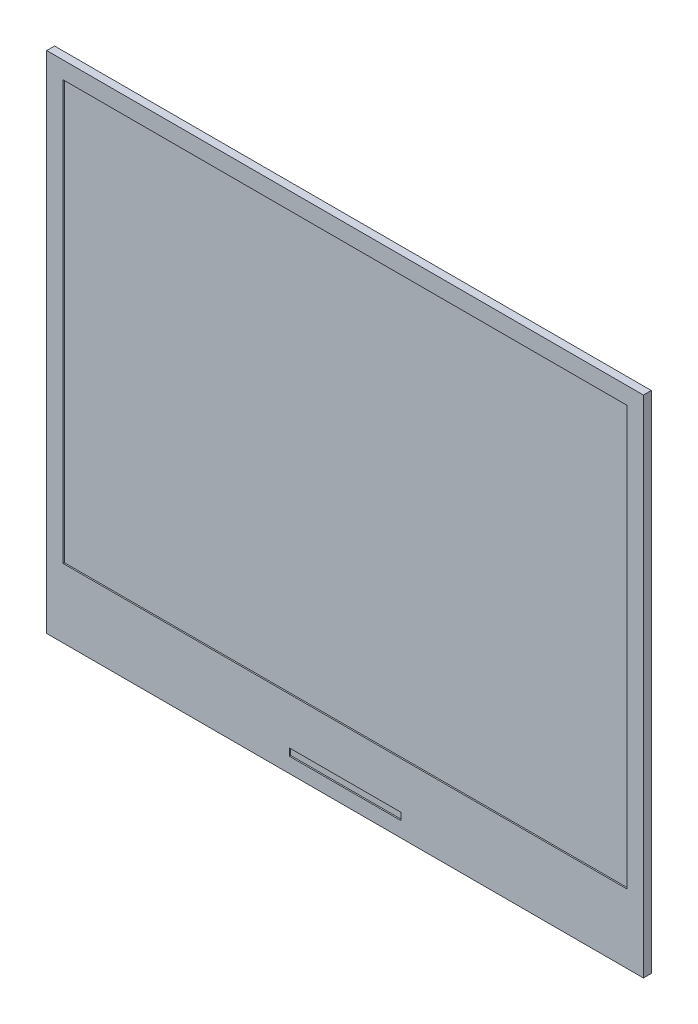
ISO-10303-21;
HEADER;
FILE_DESCRIPTION(('STEP AP214'),'2;1');
FILE_NAME('part.step','',(''),(''),'','','');
FILE_SCHEMA(('AUTOMOTIVE_DESIGN { 1 0 10303 214 1 1 1 1 }'));
ENDSEC;
DATA;
#1=APPLICATION_CONTEXT('core data for automotive mechanical design processes');
#2=APPLICATION_PROTOCOL_DEFINITION('international standard','automotive_design',2000,#1);
#3=PRODUCT_CONTEXT('',#1,'mechanical');
#4=PRODUCT('Part','Part','',(#3));
#5=PRODUCT_RELATED_PRODUCT_CATEGORY('part','',(#4));
#6=PRODUCT_DEFINITION_FORMATION('','',#4);
#7=PRODUCT_DEFINITION_CONTEXT('part definition',#1,'design');
#8=PRODUCT_DEFINITION('design','',#6,#7);
#9=PRODUCT_DEFINITION_SHAPE('','',#8);
#10=(LENGTH_UNIT() NAMED_UNIT(*) SI_UNIT(.MILLI.,.METRE.));
#11=(NAMED_UNIT(*) PLANE_ANGLE_UNIT() SI_UNIT($,.RADIAN.));
#12=(NAMED_UNIT(*) SI_UNIT($,.STERADIAN.) SOLID_ANGLE_UNIT());
#13=UNCERTAINTY_MEASURE_WITH_UNIT(LENGTH_MEASURE(1.E-05),#10,'distance_accuracy_value','');
#14=(GEOMETRIC_REPRESENTATION_CONTEXT(3) GLOBAL_UNCERTAINTY_ASSIGNED_CONTEXT((#13)) GLOBAL_UNIT_ASSIGNED_CONTEXT((#10,
#11,#12)) REPRESENTATION_CONTEXT('',''));
#15=CARTESIAN_POINT('',(0.,0.,0.));
#16=DIRECTION('',(0.,0.,1.));
#17=DIRECTION('',(1.,0.,0.));
#18=AXIS2_PLACEMENT_3D('',#15,#16,#17);
#19=CARTESIAN_POINT('',(0.,0.,1.2));
#20=DIRECTION('',(1.,0.,0.));
#21=DIRECTION('',(0.,0.,-1.));
#22=AXIS2_PLACEMENT_3D('',#19,#20,#21);
#23=PLANE('',#22);
#24=DIRECTION('',(0.,-1.,0.));
#25=VECTOR('',#24,1.);
#26=CARTESIAN_POINT('',(0.,0.,0.));
#27=LINE('',#26,#25);
#28=CARTESIAN_POINT('',(0.,77.,0.));
#29=VERTEX_POINT('',#28);
#30=CARTESIAN_POINT('',(0.,0.,0.));
#31=VERTEX_POINT('',#30);
#32=EDGE_CURVE('E214',#29,#31,#27,.T.);
#33=ORIENTED_EDGE('',*,*,#32,.T.);
#34=DIRECTION('',(0.,0.,-1.));
#35=VECTOR('',#34,1.);
#36=CARTESIAN_POINT('',(0.,0.,1.2));
#37=LINE('',#36,#35);
#38=CARTESIAN_POINT('',(0.,0.,1.2));
#39=VERTEX_POINT('',#38);
#40=EDGE_CURVE('E11',#39,#31,#37,.T.);
#41=ORIENTED_EDGE('',*,*,#40,.F.);
#42=DIRECTION('',(0.,-1.,0.));
#43=VECTOR('',#42,1.);
#44=CARTESIAN_POINT('',(0.,0.,1.2));
#45=LINE('',#44,#43);
#46=CARTESIAN_POINT('',(0.,77.,1.2));
#47=VERTEX_POINT('',#46);
#48=EDGE_CURVE('E223',#47,#39,#45,.T.);
#49=ORIENTED_EDGE('',*,*,#48,.F.);
#50=DIRECTION('',(0.,0.,-1.));
#51=VECTOR('',#50,1.);
#52=CARTESIAN_POINT('',(0.,77.,1.2));
#53=LINE('',#52,#51);
#54=EDGE_CURVE('E237',#47,#29,#53,.T.);
#55=ORIENTED_EDGE('',*,*,#54,.T.);
#56=EDGE_LOOP('',(#33,#41,#49,#55));
#57=FACE_BOUND('',#56,.T.);
#58=ADVANCED_FACE('F41',(#57),#23,.F.);
#59=CARTESIAN_POINT('',(0.,0.,1.2));
#60=DIRECTION('',(0.,1.,0.));
#61=DIRECTION('',(0.,0.,1.));
#62=AXIS2_PLACEMENT_3D('',#59,#60,#61);
#63=PLANE('',#62);
#64=DIRECTION('',(1.,0.,0.));
#65=VECTOR('',#64,1.);
#66=CARTESIAN_POINT('',(0.,0.,0.));
#67=LINE('',#66,#65);
#68=CARTESIAN_POINT('',(91.,0.,0.));
#69=VERTEX_POINT('',#68);
#70=EDGE_CURVE('E241',#31,#69,#67,.T.);
#71=ORIENTED_EDGE('',*,*,#70,.T.);
#72=DIRECTION('',(0.,0.,-1.));
#73=VECTOR('',#72,1.);
#74=CARTESIAN_POINT('',(91.,0.,1.2));
#75=LINE('',#74,#73);
#76=CARTESIAN_POINT('',(91.,0.,1.2));
#77=VERTEX_POINT('',#76);
#78=EDGE_CURVE('E49',#77,#69,#75,.T.);
#79=ORIENTED_EDGE('',*,*,#78,.F.);
#80=DIRECTION('',(1.,0.,0.));
#81=VECTOR('',#80,1.);
#82=CARTESIAN_POINT('',(0.,0.,1.2));
#83=LINE('',#82,#81);
#84=EDGE_CURVE('E227',#39,#77,#83,.T.);
#85=ORIENTED_EDGE('',*,*,#84,.F.);
#86=ORIENTED_EDGE('',*,*,#40,.T.);
#87=EDGE_LOOP('',(#71,#79,#85,#86));
#88=FACE_BOUND('',#87,.T.);
#89=ADVANCED_FACE('F277',(#88),#63,.F.);
#90=CARTESIAN_POINT('',(91.,0.,1.2));
#91=DIRECTION('',(-1.,0.,0.));
#92=DIRECTION('',(0.,0.,1.));
#93=AXIS2_PLACEMENT_3D('',#90,#91,#92);
#94=PLANE('',#93);
#95=DIRECTION('',(0.,1.,0.));
#96=VECTOR('',#95,1.);
#97=CARTESIAN_POINT('',(91.,0.,0.));
#98=LINE('',#97,#96);
#99=CARTESIAN_POINT('',(91.,77.,0.));
#100=VERTEX_POINT('',#99);
#101=EDGE_CURVE('E244',#69,#100,#98,.T.);
#102=ORIENTED_EDGE('',*,*,#101,.T.);
#103=DIRECTION('',(0.,0.,-1.));
#104=VECTOR('',#103,1.);
#105=CARTESIAN_POINT('',(91.,77.,1.2));
#106=LINE('',#105,#104);
#107=CARTESIAN_POINT('',(91.,77.,1.2));
#108=VERTEX_POINT('',#107);
#109=EDGE_CURVE('E252',#108,#100,#106,.T.);
#110=ORIENTED_EDGE('',*,*,#109,.F.);
#111=DIRECTION('',(0.,1.,0.));
#112=VECTOR('',#111,1.);
#113=CARTESIAN_POINT('',(91.,0.,1.2));
#114=LINE('',#113,#112);
#115=EDGE_CURVE('E231',#77,#108,#114,.T.);
#116=ORIENTED_EDGE('',*,*,#115,.F.);
#117=ORIENTED_EDGE('',*,*,#78,.T.);
#118=EDGE_LOOP('',(#102,#110,#116,#117));
#119=FACE_BOUND('',#118,.T.);
#120=ADVANCED_FACE('F261',(#119),#94,.F.);
#121=CARTESIAN_POINT('',(0.,77.,1.2));
#122=DIRECTION('',(0.,-1.,0.));
#123=DIRECTION('',(0.,0.,-1.));
#124=AXIS2_PLACEMENT_3D('',#121,#122,#123);
#125=PLANE('',#124);
#126=DIRECTION('',(-1.,0.,0.));
#127=VECTOR('',#126,1.);
#128=CARTESIAN_POINT('',(0.,77.,0.));
#129=LINE('',#128,#127);
#130=EDGE_CURVE('E228',#100,#29,#129,.T.);
#131=ORIENTED_EDGE('',*,*,#130,.T.);
#132=ORIENTED_EDGE('',*,*,#54,.F.);
#133=DIRECTION('',(-1.,0.,0.));
#134=VECTOR('',#133,1.);
#135=CARTESIAN_POINT('',(0.,77.,1.2));
#136=LINE('',#135,#134);
#137=EDGE_CURVE('E234',#108,#47,#136,.T.);
#138=ORIENTED_EDGE('',*,*,#137,.F.);
#139=ORIENTED_EDGE('',*,*,#109,.T.);
#140=EDGE_LOOP('',(#131,#132,#138,#139));
#141=FACE_BOUND('',#140,.T.);
#142=ADVANCED_FACE('F270',(#141),#125,.F.);
#143=CARTESIAN_POINT('',(0.,0.,1.2));
#144=DIRECTION('',(0.,0.,-1.));
#145=DIRECTION('',(-1.,0.,0.));
#146=AXIS2_PLACEMENT_3D('',#143,#144,#145);
#147=PLANE('',#146);
#148=DIRECTION('',(1.,0.,0.));
#149=VECTOR('',#148,1.);
#150=CARTESIAN_POINT('',(36.9960793012886,2.29751256416178,1.2));
#151=LINE('',#150,#149);
#152=CARTESIAN_POINT('',(36.9960793012886,2.29751256416178,1.2));
#153=VERTEX_POINT('',#152);
#154=CARTESIAN_POINT('',(53.9970134922184,2.29751256416178,1.2));
#155=VERTEX_POINT('',#154);
#156=EDGE_CURVE('E166',#153,#155,#151,.T.);
#157=ORIENTED_EDGE('',*,*,#156,.F.);
#158=DIRECTION('',(0.,-1.,0.));
#159=VECTOR('',#158,1.);
#160=CARTESIAN_POINT('',(36.9960793012886,2.29751256416178,1.2));
#161=LINE('',#160,#159);
#162=CARTESIAN_POINT('',(36.9960793012886,3.39908274213674,1.2));
#163=VERTEX_POINT('',#162);
#164=EDGE_CURVE('E56',#163,#153,#161,.T.);
#165=ORIENTED_EDGE('',*,*,#164,.F.);
#166=DIRECTION('',(-1.,0.,0.));
#167=VECTOR('',#166,1.);
#168=CARTESIAN_POINT('',(36.9960793012886,3.39908274213674,1.2));
#169=LINE('',#168,#167);
#170=CARTESIAN_POINT('',(53.9970134922184,3.39908274213674,1.2));
#171=VERTEX_POINT('',#170);
#172=EDGE_CURVE('E153',#171,#163,#169,.T.);
#173=ORIENTED_EDGE('',*,*,#172,.F.);
#174=DIRECTION('',(0.,1.,0.));
#175=VECTOR('',#174,1.);
#176=CARTESIAN_POINT('',(53.9970134922184,2.29751256416178,1.2));
#177=LINE('',#176,#175);
#178=EDGE_CURVE('E157',#155,#171,#177,.T.);
#179=ORIENTED_EDGE('',*,*,#178,.F.);
#180=EDGE_LOOP('',(#157,#165,#173,#179));
#181=FACE_BOUND('',#180,.T.);
#182=DIRECTION('',(-1.,0.,0.));
#183=VECTOR('',#182,1.);
#184=CARTESIAN_POINT('',(2.49983863575474,74.3898748547093,1.2));
#185=LINE('',#184,#183);
#186=CARTESIAN_POINT('',(88.4964912916319,74.3898748547093,1.2));
#187=VERTEX_POINT('',#186);
#188=CARTESIAN_POINT('',(2.49983863575474,74.3898748547093,1.2));
#189=VERTEX_POINT('',#188);
#190=EDGE_CURVE('E200',#187,#189,#185,.T.);
#191=ORIENTED_EDGE('',*,*,#190,.F.);
#192=DIRECTION('',(0.,1.,0.));
#193=VECTOR('',#192,1.);
#194=CARTESIAN_POINT('',(88.4964912916319,74.3898748547093,1.2));
#195=LINE('',#194,#193);
#196=CARTESIAN_POINT('',(88.4964912916319,10.5026349995511,1.2));
#197=VERTEX_POINT('',#196);
#198=EDGE_CURVE('E64',#197,#187,#195,.T.);
#199=ORIENTED_EDGE('',*,*,#198,.F.);
#200=DIRECTION('',(1.,0.,0.));
#201=VECTOR('',#200,1.);
#202=CARTESIAN_POINT('',(2.49983863575474,10.5026349995511,1.2));
#203=LINE('',#202,#201);
#204=CARTESIAN_POINT('',(2.49983863575474,10.5026349995511,1.2));
#205=VERTEX_POINT('',#204);
#206=EDGE_CURVE('E185',#205,#197,#203,.T.);
#207=ORIENTED_EDGE('',*,*,#206,.F.);
#208=DIRECTION('',(0.,-1.,0.));
#209=VECTOR('',#208,1.);
#210=CARTESIAN_POINT('',(2.49983863575474,74.3898748547093,1.2));
#211=LINE('',#210,#209);
#212=EDGE_CURVE('E204',#189,#205,#211,.T.);
#213=ORIENTED_EDGE('',*,*,#212,.F.);
#214=EDGE_LOOP('',(#191,#199,#207,#213));
#215=FACE_BOUND('',#214,.T.);
#216=ORIENTED_EDGE('',*,*,#48,.T.);
#217=ORIENTED_EDGE('',*,*,#84,.T.);
#218=ORIENTED_EDGE('',*,*,#115,.T.);
#219=ORIENTED_EDGE('',*,*,#137,.T.);
#220=EDGE_LOOP('',(#216,#217,#218,#219));
#221=FACE_BOUND('',#220,.T.);
#222=ADVANCED_FACE('F276',(#181,#215,#221),#147,.F.);
#223=CARTESIAN_POINT('',(0.,0.,0.));
#224=DIRECTION('',(0.,0.,-1.));
#225=DIRECTION('',(-1.,0.,0.));
#226=AXIS2_PLACEMENT_3D('',#223,#224,#225);
#227=PLANE('',#226);
#228=ORIENTED_EDGE('',*,*,#32,.F.);
#229=ORIENTED_EDGE('',*,*,#130,.F.);
#230=ORIENTED_EDGE('',*,*,#101,.F.);
#231=ORIENTED_EDGE('',*,*,#70,.F.);
#232=EDGE_LOOP('',(#228,#229,#230,#231));
#233=FACE_BOUND('',#232,.T.);
#234=ADVANCED_FACE('F267',(#233),#227,.T.);
#235=CARTESIAN_POINT('',(88.4964912916319,74.3898748547093,1.));
#236=DIRECTION('',(1.,0.,0.));
#237=DIRECTION('',(0.,0.,-1.));
#238=AXIS2_PLACEMENT_3D('',#235,#236,#237);
#239=PLANE('',#238);
#240=ORIENTED_EDGE('',*,*,#198,.T.);
#241=DIRECTION('',(0.,0.,1.));
#242=VECTOR('',#241,1.);
#243=CARTESIAN_POINT('',(88.4964912916319,74.3898748547093,1.));
#244=LINE('',#243,#242);
#245=CARTESIAN_POINT('',(88.4964912916319,74.3898748547093,1.));
#246=VERTEX_POINT('',#245);
#247=EDGE_CURVE('E197',#246,#187,#244,.T.);
#248=ORIENTED_EDGE('',*,*,#247,.F.);
#249=DIRECTION('',(0.,1.,0.));
#250=VECTOR('',#249,1.);
#251=CARTESIAN_POINT('',(88.4964912916319,74.3898748547093,1.));
#252=LINE('',#251,#250);
#253=CARTESIAN_POINT('',(88.4964912916319,10.5026349995511,1.));
#254=VERTEX_POINT('',#253);
#255=EDGE_CURVE('E180',#254,#246,#252,.T.);
#256=ORIENTED_EDGE('',*,*,#255,.F.);
#257=DIRECTION('',(0.,0.,1.));
#258=VECTOR('',#257,1.);
#259=CARTESIAN_POINT('',(88.4964912916319,10.5026349995511,1.));
#260=LINE('',#259,#258);
#261=EDGE_CURVE('E211',#254,#197,#260,.T.);
#262=ORIENTED_EDGE('',*,*,#261,.T.);
#263=EDGE_LOOP('',(#240,#248,#256,#262));
#264=FACE_BOUND('',#263,.T.);
#265=ADVANCED_FACE('F289',(#264),#239,.F.);
#266=CARTESIAN_POINT('',(2.49983863575474,10.5026349995511,1.));
#267=DIRECTION('',(0.,-1.,0.));
#268=DIRECTION('',(0.,0.,-1.));
#269=AXIS2_PLACEMENT_3D('',#266,#267,#268);
#270=PLANE('',#269);
#271=ORIENTED_EDGE('',*,*,#206,.T.);
#272=ORIENTED_EDGE('',*,*,#261,.F.);
#273=DIRECTION('',(1.,0.,0.));
#274=VECTOR('',#273,1.);
#275=CARTESIAN_POINT('',(2.49983863575474,10.5026349995511,1.));
#276=LINE('',#275,#274);
#277=CARTESIAN_POINT('',(2.49983863575474,10.5026349995511,1.));
#278=VERTEX_POINT('',#277);
#279=EDGE_CURVE('E193',#278,#254,#276,.T.);
#280=ORIENTED_EDGE('',*,*,#279,.F.);
#281=DIRECTION('',(0.,0.,1.));
#282=VECTOR('',#281,1.);
#283=CARTESIAN_POINT('',(2.49983863575474,10.5026349995511,1.));
#284=LINE('',#283,#282);
#285=EDGE_CURVE('E215',#278,#205,#284,.T.);
#286=ORIENTED_EDGE('',*,*,#285,.T.);
#287=EDGE_LOOP('',(#271,#272,#280,#286));
#288=FACE_BOUND('',#287,.T.);
#289=ADVANCED_FACE('F295',(#288),#270,.F.);
#290=CARTESIAN_POINT('',(2.49983863575474,74.3898748547093,1.));
#291=DIRECTION('',(-1.,0.,0.));
#292=DIRECTION('',(0.,0.,1.));
#293=AXIS2_PLACEMENT_3D('',#290,#291,#292);
#294=PLANE('',#293);
#295=ORIENTED_EDGE('',*,*,#212,.T.);
#296=ORIENTED_EDGE('',*,*,#285,.F.);
#297=DIRECTION('',(0.,-1.,0.));
#298=VECTOR('',#297,1.);
#299=CARTESIAN_POINT('',(2.49983863575474,74.3898748547093,1.));
#300=LINE('',#299,#298);
#301=CARTESIAN_POINT('',(2.49983863575474,74.3898748547093,1.));
#302=VERTEX_POINT('',#301);
#303=EDGE_CURVE('E189',#302,#278,#300,.T.);
#304=ORIENTED_EDGE('',*,*,#303,.F.);
#305=DIRECTION('',(0.,0.,1.));
#306=VECTOR('',#305,1.);
#307=CARTESIAN_POINT('',(2.49983863575474,74.3898748547093,1.));
#308=LINE('',#307,#306);
#309=EDGE_CURVE('E218',#302,#189,#308,.T.);
#310=ORIENTED_EDGE('',*,*,#309,.T.);
#311=EDGE_LOOP('',(#295,#296,#304,#310));
#312=FACE_BOUND('',#311,.T.);
#313=ADVANCED_FACE('F300',(#312),#294,.F.);
#314=CARTESIAN_POINT('',(2.49983863575474,74.3898748547093,1.));
#315=DIRECTION('',(0.,1.,0.));
#316=DIRECTION('',(0.,0.,1.));
#317=AXIS2_PLACEMENT_3D('',#314,#315,#316);
#318=PLANE('',#317);
#319=ORIENTED_EDGE('',*,*,#190,.T.);
#320=ORIENTED_EDGE('',*,*,#309,.F.);
#321=DIRECTION('',(-1.,0.,0.));
#322=VECTOR('',#321,1.);
#323=CARTESIAN_POINT('',(2.49983863575474,74.3898748547093,1.));
#324=LINE('',#323,#322);
#325=EDGE_CURVE('E184',#246,#302,#324,.T.);
#326=ORIENTED_EDGE('',*,*,#325,.F.);
#327=ORIENTED_EDGE('',*,*,#247,.T.);
#328=EDGE_LOOP('',(#319,#320,#326,#327));
#329=FACE_BOUND('',#328,.T.);
#330=ADVANCED_FACE('F296',(#329),#318,.F.);
#331=CARTESIAN_POINT('',(0.,0.,1.));
#332=DIRECTION('',(0.,0.,1.));
#333=DIRECTION('',(1.,0.,0.));
#334=AXIS2_PLACEMENT_3D('',#331,#332,#333);
#335=PLANE('',#334);
#336=ORIENTED_EDGE('',*,*,#255,.T.);
#337=ORIENTED_EDGE('',*,*,#325,.T.);
#338=ORIENTED_EDGE('',*,*,#303,.T.);
#339=ORIENTED_EDGE('',*,*,#279,.T.);
#340=EDGE_LOOP('',(#336,#337,#338,#339));
#341=FACE_BOUND('',#340,.T.);
#342=ADVANCED_FACE('F299',(#341),#335,.T.);
#343=CARTESIAN_POINT('',(36.9960793012886,2.29751256416178,1.));
#344=DIRECTION('',(-1.,0.,0.));
#345=DIRECTION('',(0.,0.,1.));
#346=AXIS2_PLACEMENT_3D('',#343,#344,#345);
#347=PLANE('',#346);
#348=ORIENTED_EDGE('',*,*,#164,.T.);
#349=DIRECTION('',(0.,0.,1.));
#350=VECTOR('',#349,1.);
#351=CARTESIAN_POINT('',(36.9960793012886,2.29751256416178,1.));
#352=LINE('',#351,#350);
#353=CARTESIAN_POINT('',(36.9960793012886,2.29751256416178,1.));
#354=VERTEX_POINT('',#353);
#355=EDGE_CURVE('E128',#354,#153,#352,.T.);
#356=ORIENTED_EDGE('',*,*,#355,.F.);
#357=DIRECTION('',(0.,-1.,0.));
#358=VECTOR('',#357,1.);
#359=CARTESIAN_POINT('',(36.9960793012886,2.29751256416178,1.));
#360=LINE('',#359,#358);
#361=CARTESIAN_POINT('',(36.9960793012886,3.39908274213674,1.));
#362=VERTEX_POINT('',#361);
#363=EDGE_CURVE('E132',#362,#354,#360,.T.);
#364=ORIENTED_EDGE('',*,*,#363,.F.);
#365=DIRECTION('',(0.,0.,1.));
#366=VECTOR('',#365,1.);
#367=CARTESIAN_POINT('',(36.9960793012886,3.39908274213674,1.));
#368=LINE('',#367,#366);
#369=EDGE_CURVE('E172',#362,#163,#368,.T.);
#370=ORIENTED_EDGE('',*,*,#369,.T.);
#371=EDGE_LOOP('',(#348,#356,#364,#370));
#372=FACE_BOUND('',#371,.T.);
#373=ADVANCED_FACE('F130',(#372),#347,.F.);
#374=CARTESIAN_POINT('',(36.9960793012886,3.39908274213674,1.));
#375=DIRECTION('',(0.,1.,0.));
#376=DIRECTION('',(0.,0.,1.));
#377=AXIS2_PLACEMENT_3D('',#374,#375,#376);
#378=PLANE('',#377);
#379=ORIENTED_EDGE('',*,*,#172,.T.);
#380=ORIENTED_EDGE('',*,*,#369,.F.);
#381=DIRECTION('',(-1.,0.,0.));
#382=VECTOR('',#381,1.);
#383=CARTESIAN_POINT('',(36.9960793012886,3.39908274213674,1.));
#384=LINE('',#383,#382);
#385=CARTESIAN_POINT('',(53.9970134922184,3.39908274213674,1.));
#386=VERTEX_POINT('',#385);
#387=EDGE_CURVE('E139',#386,#362,#384,.T.);
#388=ORIENTED_EDGE('',*,*,#387,.F.);
#389=DIRECTION('',(0.,0.,1.));
#390=VECTOR('',#389,1.);
#391=CARTESIAN_POINT('',(53.9970134922184,3.39908274213674,1.));
#392=LINE('',#391,#390);
#393=EDGE_CURVE('E175',#386,#171,#392,.T.);
#394=ORIENTED_EDGE('',*,*,#393,.T.);
#395=EDGE_LOOP('',(#379,#380,#388,#394));
#396=FACE_BOUND('',#395,.T.);
#397=ADVANCED_FACE('F313',(#396),#378,.F.);
#398=CARTESIAN_POINT('',(53.9970134922184,2.29751256416178,1.));
#399=DIRECTION('',(1.,0.,0.));
#400=DIRECTION('',(0.,0.,-1.));
#401=AXIS2_PLACEMENT_3D('',#398,#399,#400);
#402=PLANE('',#401);
#403=ORIENTED_EDGE('',*,*,#178,.T.);
#404=ORIENTED_EDGE('',*,*,#393,.F.);
#405=DIRECTION('',(0.,1.,0.));
#406=VECTOR('',#405,1.);
#407=CARTESIAN_POINT('',(53.9970134922184,2.29751256416178,1.));
#408=LINE('',#407,#406);
#409=CARTESIAN_POINT('',(53.9970134922184,2.29751256416178,1.));
#410=VERTEX_POINT('',#409);
#411=EDGE_CURVE('E148',#410,#386,#408,.T.);
#412=ORIENTED_EDGE('',*,*,#411,.F.);
#413=DIRECTION('',(0.,0.,1.));
#414=VECTOR('',#413,1.);
#415=CARTESIAN_POINT('',(53.9970134922184,2.29751256416178,1.));
#416=LINE('',#415,#414);
#417=EDGE_CURVE('E138',#410,#155,#416,.T.);
#418=ORIENTED_EDGE('',*,*,#417,.T.);
#419=EDGE_LOOP('',(#403,#404,#412,#418));
#420=FACE_BOUND('',#419,.T.);
#421=ADVANCED_FACE('F316',(#420),#402,.F.);
#422=CARTESIAN_POINT('',(36.9960793012886,2.29751256416178,1.));
#423=DIRECTION('',(0.,-1.,0.));
#424=DIRECTION('',(0.,0.,-1.));
#425=AXIS2_PLACEMENT_3D('',#422,#423,#424);
#426=PLANE('',#425);
#427=ORIENTED_EDGE('',*,*,#156,.T.);
#428=ORIENTED_EDGE('',*,*,#417,.F.);
#429=DIRECTION('',(1.,0.,0.));
#430=VECTOR('',#429,1.);
#431=CARTESIAN_POINT('',(36.9960793012886,2.29751256416178,1.));
#432=LINE('',#431,#430);
#433=EDGE_CURVE('E142',#354,#410,#432,.T.);
#434=ORIENTED_EDGE('',*,*,#433,.F.);
#435=ORIENTED_EDGE('',*,*,#355,.T.);
#436=EDGE_LOOP('',(#427,#428,#434,#435));
#437=FACE_BOUND('',#436,.T.);
#438=ADVANCED_FACE('F143',(#437),#426,.F.);
#439=CARTESIAN_POINT('',(0.,0.,1.));
#440=DIRECTION('',(0.,0.,-1.));
#441=DIRECTION('',(-1.,0.,0.));
#442=AXIS2_PLACEMENT_3D('',#439,#440,#441);
#443=PLANE('',#442);
#444=ORIENTED_EDGE('',*,*,#363,.T.);
#445=ORIENTED_EDGE('',*,*,#433,.T.);
#446=ORIENTED_EDGE('',*,*,#411,.T.);
#447=ORIENTED_EDGE('',*,*,#387,.T.);
#448=EDGE_LOOP('',(#444,#445,#446,#447));
#449=FACE_BOUND('',#448,.T.);
#450=ADVANCED_FACE('F150',(#449),#443,.F.);
#451=CLOSED_SHELL('',(#58,#89,#120,#142,#222,#234,#265,#289,#313,#330,#342,#373,#397,#421,#438,#450));
#452=MANIFOLD_SOLID_BREP('B2',#451);
#453=ADVANCED_BREP_SHAPE_REPRESENTATION('',(#18,#452),#14);
#454=SHAPE_DEFINITION_REPRESENTATION(#9,#453);
ENDSEC;
END-ISO-10303-21;
